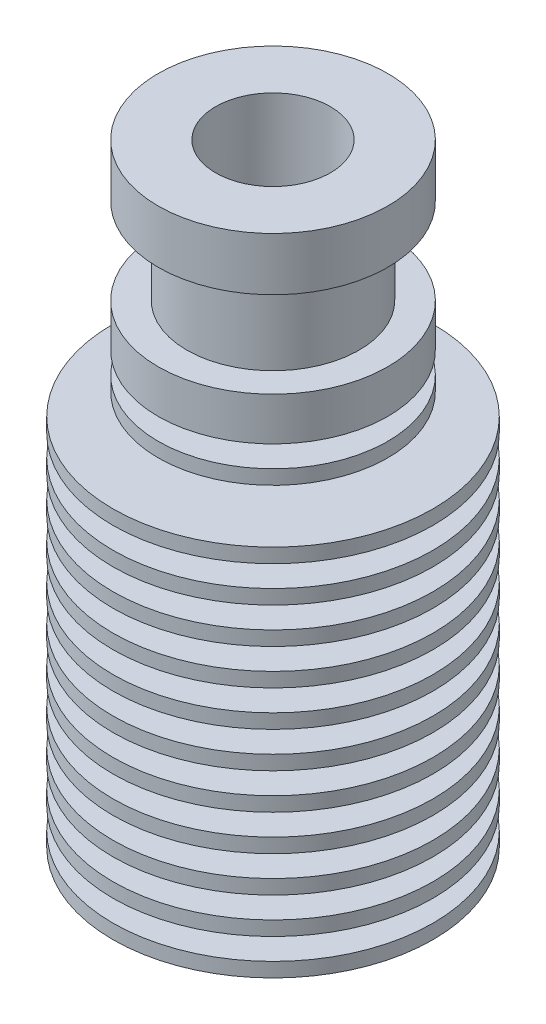
ISO-10303-21;
HEADER;
FILE_DESCRIPTION(('STEP AP214'),'2;1');
FILE_NAME('part.step','',(''),(''),'','','');
FILE_SCHEMA(('AUTOMOTIVE_DESIGN { 1 0 10303 214 1 1 1 1 }'));
ENDSEC;
DATA;
#1=APPLICATION_CONTEXT('core data for automotive mechanical design processes');
#2=APPLICATION_PROTOCOL_DEFINITION('international standard','automotive_design',2000,#1);
#3=PRODUCT_CONTEXT('',#1,'mechanical');
#4=PRODUCT('Part','Part','',(#3));
#5=PRODUCT_RELATED_PRODUCT_CATEGORY('part','',(#4));
#6=PRODUCT_DEFINITION_FORMATION('','',#4);
#7=PRODUCT_DEFINITION_CONTEXT('part definition',#1,'design');
#8=PRODUCT_DEFINITION('design','',#6,#7);
#9=PRODUCT_DEFINITION_SHAPE('','',#8);
#10=(LENGTH_UNIT() NAMED_UNIT(*) SI_UNIT(.MILLI.,.METRE.));
#11=(NAMED_UNIT(*) PLANE_ANGLE_UNIT() SI_UNIT($,.RADIAN.));
#12=(NAMED_UNIT(*) SI_UNIT($,.STERADIAN.) SOLID_ANGLE_UNIT());
#13=UNCERTAINTY_MEASURE_WITH_UNIT(LENGTH_MEASURE(1.E-05),#10,'distance_accuracy_value','');
#14=(GEOMETRIC_REPRESENTATION_CONTEXT(3) GLOBAL_UNCERTAINTY_ASSIGNED_CONTEXT((#13)) GLOBAL_UNIT_ASSIGNED_CONTEXT((#10,
#11,#12)) REPRESENTATION_CONTEXT('',''));
#15=CARTESIAN_POINT('',(0.,0.,0.));
#16=DIRECTION('',(0.,0.,1.));
#17=DIRECTION('',(1.,0.,0.));
#18=AXIS2_PLACEMENT_3D('',#15,#16,#17);
#19=CARTESIAN_POINT('',(-11.151,17.5,11.151));
#20=DIRECTION('',(0.,-1.,0.));
#21=DIRECTION('',(0.,0.,-1.));
#22=AXIS2_PLACEMENT_3D('',#19,#20,#21);
#23=PLANE('',#22);
#24=CARTESIAN_POINT('',(0.,17.5,0.));
#25=DIRECTION('',(0.,1.,0.));
#26=DIRECTION('',(0.,0.,1.));
#27=AXIS2_PLACEMENT_3D('',#24,#25,#26);
#28=CIRCLE('',#27,5.21388331075437);
#29=CARTESIAN_POINT('',(0.,17.5,5.21388331075437));
#30=VERTEX_POINT('',#29);
#31=EDGE_CURVE('E259',#30,#30,#28,.F.);
#32=ORIENTED_EDGE('',*,*,#31,.F.);
#33=EDGE_LOOP('',(#32));
#34=FACE_BOUND('',#33,.T.);
#35=CARTESIAN_POINT('',(0.,17.5,0.));
#36=DIRECTION('',(0.,1.,0.));
#37=DIRECTION('',(0.,0.,1.));
#38=AXIS2_PLACEMENT_3D('',#35,#36,#37);
#39=CIRCLE('',#38,11.15);
#40=CARTESIAN_POINT('',(0.,17.5,11.15));
#41=VERTEX_POINT('',#40);
#42=EDGE_CURVE('E18',#41,#41,#39,.T.);
#43=ORIENTED_EDGE('',*,*,#42,.F.);
#44=EDGE_LOOP('',(#43));
#45=FACE_BOUND('',#44,.T.);
#46=ADVANCED_FACE('F14',(#34,#45),#23,.T.);
#47=CARTESIAN_POINT('',(0.,17.5,0.));
#48=DIRECTION('',(0.,1.,0.));
#49=DIRECTION('',(0.,0.,1.));
#50=AXIS2_PLACEMENT_3D('',#47,#48,#49);
#51=CYLINDRICAL_SURFACE('',#50,11.15);
#52=CARTESIAN_POINT('',(0.,18.5,0.));
#53=DIRECTION('',(0.,1.,0.));
#54=DIRECTION('',(0.,0.,1.));
#55=AXIS2_PLACEMENT_3D('',#52,#53,#54);
#56=CIRCLE('',#55,11.15);
#57=CARTESIAN_POINT('',(0.,18.5,11.15));
#58=VERTEX_POINT('',#57);
#59=EDGE_CURVE('E256',#58,#58,#56,.T.);
#60=ORIENTED_EDGE('',*,*,#59,.F.);
#61=EDGE_LOOP('',(#60));
#62=FACE_BOUND('',#61,.T.);
#63=ORIENTED_EDGE('',*,*,#42,.T.);
#64=EDGE_LOOP('',(#63));
#65=FACE_BOUND('',#64,.T.);
#66=ADVANCED_FACE('F268',(#62,#65),#51,.T.);
#67=CARTESIAN_POINT('',(0.,16.,0.));
#68=DIRECTION('',(0.,1.,0.));
#69=DIRECTION('',(0.,0.,1.));
#70=AXIS2_PLACEMENT_3D('',#67,#68,#69);
#71=CYLINDRICAL_SURFACE('',#70,5.21388331075437);
#72=ORIENTED_EDGE('',*,*,#31,.T.);
#73=EDGE_LOOP('',(#72));
#74=FACE_BOUND('',#73,.T.);
#75=CARTESIAN_POINT('',(0.,16.,0.));
#76=DIRECTION('',(0.,1.,0.));
#77=DIRECTION('',(0.,0.,1.));
#78=AXIS2_PLACEMENT_3D('',#75,#76,#77);
#79=CIRCLE('',#78,5.21388331075437);
#80=CARTESIAN_POINT('',(0.,16.,5.21388331075437));
#81=VERTEX_POINT('',#80);
#82=EDGE_CURVE('E252',#81,#81,#79,.F.);
#83=ORIENTED_EDGE('',*,*,#82,.F.);
#84=EDGE_LOOP('',(#83));
#85=FACE_BOUND('',#84,.T.);
#86=ADVANCED_FACE('F278',(#74,#85),#71,.T.);
#87=CARTESIAN_POINT('',(-11.151,18.5,-11.151));
#88=DIRECTION('',(0.,1.,0.));
#89=DIRECTION('',(0.,0.,1.));
#90=AXIS2_PLACEMENT_3D('',#87,#88,#89);
#91=PLANE('',#90);
#92=CARTESIAN_POINT('',(0.,18.5,0.));
#93=DIRECTION('',(0.,1.,0.));
#94=DIRECTION('',(0.,0.,1.));
#95=AXIS2_PLACEMENT_3D('',#92,#93,#94);
#96=CIRCLE('',#95,5.08286386254677);
#97=CARTESIAN_POINT('',(0.,18.5,5.08286386254677));
#98=VERTEX_POINT('',#97);
#99=EDGE_CURVE('E248',#98,#98,#96,.T.);
#100=ORIENTED_EDGE('',*,*,#99,.F.);
#101=EDGE_LOOP('',(#100));
#102=FACE_BOUND('',#101,.T.);
#103=ORIENTED_EDGE('',*,*,#59,.T.);
#104=EDGE_LOOP('',(#103));
#105=FACE_BOUND('',#104,.T.);
#106=ADVANCED_FACE('F505',(#102,#105),#91,.T.);
#107=CARTESIAN_POINT('',(-11.151,16.,-11.151));
#108=DIRECTION('',(0.,1.,0.));
#109=DIRECTION('',(0.,0.,1.));
#110=AXIS2_PLACEMENT_3D('',#107,#108,#109);
#111=PLANE('',#110);
#112=ORIENTED_EDGE('',*,*,#82,.T.);
#113=EDGE_LOOP('',(#112));
#114=FACE_BOUND('',#113,.T.);
#115=CARTESIAN_POINT('',(0.,16.,0.));
#116=DIRECTION('',(0.,1.,0.));
#117=DIRECTION('',(0.,0.,1.));
#118=AXIS2_PLACEMENT_3D('',#115,#116,#117);
#119=CIRCLE('',#118,11.15);
#120=CARTESIAN_POINT('',(0.,16.,11.15));
#121=VERTEX_POINT('',#120);
#122=EDGE_CURVE('E244',#121,#121,#119,.F.);
#123=ORIENTED_EDGE('',*,*,#122,.F.);
#124=EDGE_LOOP('',(#123));
#125=FACE_BOUND('',#124,.T.);
#126=ADVANCED_FACE('F502',(#114,#125),#111,.T.);
#127=CARTESIAN_POINT('',(0.,18.5,0.));
#128=DIRECTION('',(0.,1.,0.));
#129=DIRECTION('',(0.,0.,1.));
#130=AXIS2_PLACEMENT_3D('',#127,#128,#129);
#131=CYLINDRICAL_SURFACE('',#130,5.08286386254677);
#132=CARTESIAN_POINT('',(0.,20.,0.));
#133=DIRECTION('',(0.,1.,0.));
#134=DIRECTION('',(0.,0.,1.));
#135=AXIS2_PLACEMENT_3D('',#132,#133,#134);
#136=CIRCLE('',#135,5.08286386254677);
#137=CARTESIAN_POINT('',(0.,20.,5.08286386254677));
#138=VERTEX_POINT('',#137);
#139=EDGE_CURVE('E240',#138,#138,#136,.T.);
#140=ORIENTED_EDGE('',*,*,#139,.F.);
#141=EDGE_LOOP('',(#140));
#142=FACE_BOUND('',#141,.T.);
#143=ORIENTED_EDGE('',*,*,#99,.T.);
#144=EDGE_LOOP('',(#143));
#145=FACE_BOUND('',#144,.T.);
#146=ADVANCED_FACE('F498',(#142,#145),#131,.T.);
#147=CARTESIAN_POINT('',(0.,15.,0.));
#148=DIRECTION('',(0.,1.,0.));
#149=DIRECTION('',(0.,0.,1.));
#150=AXIS2_PLACEMENT_3D('',#147,#148,#149);
#151=CYLINDRICAL_SURFACE('',#150,11.15);
#152=ORIENTED_EDGE('',*,*,#122,.T.);
#153=EDGE_LOOP('',(#152));
#154=FACE_BOUND('',#153,.T.);
#155=CARTESIAN_POINT('',(0.,15.,0.));
#156=DIRECTION('',(0.,1.,0.));
#157=DIRECTION('',(0.,0.,1.));
#158=AXIS2_PLACEMENT_3D('',#155,#156,#157);
#159=CIRCLE('',#158,11.15);
#160=CARTESIAN_POINT('',(0.,15.,11.15));
#161=VERTEX_POINT('',#160);
#162=EDGE_CURVE('E236',#161,#161,#159,.F.);
#163=ORIENTED_EDGE('',*,*,#162,.F.);
#164=EDGE_LOOP('',(#163));
#165=FACE_BOUND('',#164,.T.);
#166=ADVANCED_FACE('F494',(#154,#165),#151,.T.);
#167=CARTESIAN_POINT('',(-11.151,20.,11.151));
#168=DIRECTION('',(0.,-1.,0.));
#169=DIRECTION('',(0.,0.,-1.));
#170=AXIS2_PLACEMENT_3D('',#167,#168,#169);
#171=PLANE('',#170);
#172=ORIENTED_EDGE('',*,*,#139,.T.);
#173=EDGE_LOOP('',(#172));
#174=FACE_BOUND('',#173,.T.);
#175=CARTESIAN_POINT('',(0.,20.,0.));
#176=DIRECTION('',(0.,1.,0.));
#177=DIRECTION('',(0.,0.,1.));
#178=AXIS2_PLACEMENT_3D('',#175,#176,#177);
#179=CIRCLE('',#178,11.15);
#180=CARTESIAN_POINT('',(0.,20.,11.15));
#181=VERTEX_POINT('',#180);
#182=EDGE_CURVE('E232',#181,#181,#179,.T.);
#183=ORIENTED_EDGE('',*,*,#182,.F.);
#184=EDGE_LOOP('',(#183));
#185=FACE_BOUND('',#184,.T.);
#186=ADVANCED_FACE('F490',(#174,#185),#171,.T.);
#187=CARTESIAN_POINT('',(-11.151,15.,11.151));
#188=DIRECTION('',(0.,-1.,0.));
#189=DIRECTION('',(0.,0.,-1.));
#190=AXIS2_PLACEMENT_3D('',#187,#188,#189);
#191=PLANE('',#190);
#192=CARTESIAN_POINT('',(0.,15.,0.));
#193=DIRECTION('',(0.,1.,0.));
#194=DIRECTION('',(0.,0.,1.));
#195=AXIS2_PLACEMENT_3D('',#192,#193,#194);
#196=CIRCLE('',#195,5.34490275896198);
#197=CARTESIAN_POINT('',(0.,15.,5.34490275896198));
#198=VERTEX_POINT('',#197);
#199=EDGE_CURVE('E229',#198,#198,#196,.F.);
#200=ORIENTED_EDGE('',*,*,#199,.F.);
#201=EDGE_LOOP('',(#200));
#202=FACE_BOUND('',#201,.T.);
#203=ORIENTED_EDGE('',*,*,#162,.T.);
#204=EDGE_LOOP('',(#203));
#205=FACE_BOUND('',#204,.T.);
#206=ADVANCED_FACE('F486',(#202,#205),#191,.T.);
#207=CARTESIAN_POINT('',(0.,20.,0.));
#208=DIRECTION('',(0.,1.,0.));
#209=DIRECTION('',(0.,0.,1.));
#210=AXIS2_PLACEMENT_3D('',#207,#208,#209);
#211=CYLINDRICAL_SURFACE('',#210,11.15);
#212=CARTESIAN_POINT('',(0.,21.,0.));
#213=DIRECTION('',(0.,1.,0.));
#214=DIRECTION('',(0.,0.,1.));
#215=AXIS2_PLACEMENT_3D('',#212,#213,#214);
#216=CIRCLE('',#215,11.15);
#217=CARTESIAN_POINT('',(0.,21.,11.15));
#218=VERTEX_POINT('',#217);
#219=EDGE_CURVE('E225',#218,#218,#216,.T.);
#220=ORIENTED_EDGE('',*,*,#219,.F.);
#221=EDGE_LOOP('',(#220));
#222=FACE_BOUND('',#221,.T.);
#223=ORIENTED_EDGE('',*,*,#182,.T.);
#224=EDGE_LOOP('',(#223));
#225=FACE_BOUND('',#224,.T.);
#226=ADVANCED_FACE('F482',(#222,#225),#211,.T.);
#227=CARTESIAN_POINT('',(0.,13.5,0.));
#228=DIRECTION('',(0.,1.,0.));
#229=DIRECTION('',(0.,0.,1.));
#230=AXIS2_PLACEMENT_3D('',#227,#228,#229);
#231=CYLINDRICAL_SURFACE('',#230,5.34490275896198);
#232=ORIENTED_EDGE('',*,*,#199,.T.);
#233=EDGE_LOOP('',(#232));
#234=FACE_BOUND('',#233,.T.);
#235=CARTESIAN_POINT('',(0.,13.5,0.));
#236=DIRECTION('',(0.,1.,0.));
#237=DIRECTION('',(0.,0.,1.));
#238=AXIS2_PLACEMENT_3D('',#235,#236,#237);
#239=CIRCLE('',#238,5.34490275896198);
#240=CARTESIAN_POINT('',(0.,13.5,5.34490275896198));
#241=VERTEX_POINT('',#240);
#242=EDGE_CURVE('E222',#241,#241,#239,.F.);
#243=ORIENTED_EDGE('',*,*,#242,.F.);
#244=EDGE_LOOP('',(#243));
#245=FACE_BOUND('',#244,.T.);
#246=ADVANCED_FACE('F478',(#234,#245),#231,.T.);
#247=CARTESIAN_POINT('',(-11.151,21.,-11.151));
#248=DIRECTION('',(0.,1.,0.));
#249=DIRECTION('',(0.,0.,1.));
#250=AXIS2_PLACEMENT_3D('',#247,#248,#249);
#251=PLANE('',#250);
#252=CARTESIAN_POINT('',(0.,21.,0.));
#253=DIRECTION('',(0.,1.,0.));
#254=DIRECTION('',(0.,0.,1.));
#255=AXIS2_PLACEMENT_3D('',#252,#253,#254);
#256=CIRCLE('',#255,4.95184441433916);
#257=CARTESIAN_POINT('',(0.,21.,4.95184441433916));
#258=VERTEX_POINT('',#257);
#259=EDGE_CURVE('E218',#258,#258,#256,.T.);
#260=ORIENTED_EDGE('',*,*,#259,.F.);
#261=EDGE_LOOP('',(#260));
#262=FACE_BOUND('',#261,.T.);
#263=ORIENTED_EDGE('',*,*,#219,.T.);
#264=EDGE_LOOP('',(#263));
#265=FACE_BOUND('',#264,.T.);
#266=ADVANCED_FACE('F474',(#262,#265),#251,.T.);
#267=CARTESIAN_POINT('',(-11.151,13.5,-11.151));
#268=DIRECTION('',(0.,1.,0.));
#269=DIRECTION('',(0.,0.,1.));
#270=AXIS2_PLACEMENT_3D('',#267,#268,#269);
#271=PLANE('',#270);
#272=ORIENTED_EDGE('',*,*,#242,.T.);
#273=EDGE_LOOP('',(#272));
#274=FACE_BOUND('',#273,.T.);
#275=CARTESIAN_POINT('',(0.,13.5,0.));
#276=DIRECTION('',(0.,1.,0.));
#277=DIRECTION('',(0.,0.,1.));
#278=AXIS2_PLACEMENT_3D('',#275,#276,#277);
#279=CIRCLE('',#278,11.15);
#280=CARTESIAN_POINT('',(0.,13.5,11.15));
#281=VERTEX_POINT('',#280);
#282=EDGE_CURVE('E214',#281,#281,#279,.F.);
#283=ORIENTED_EDGE('',*,*,#282,.F.);
#284=EDGE_LOOP('',(#283));
#285=FACE_BOUND('',#284,.T.);
#286=ADVANCED_FACE('F470',(#274,#285),#271,.T.);
#287=CARTESIAN_POINT('',(0.,21.,0.));
#288=DIRECTION('',(0.,1.,0.));
#289=DIRECTION('',(0.,0.,1.));
#290=AXIS2_PLACEMENT_3D('',#287,#288,#289);
#291=CYLINDRICAL_SURFACE('',#290,4.95184441433916);
#292=CARTESIAN_POINT('',(0.,22.5,0.));
#293=DIRECTION('',(0.,1.,0.));
#294=DIRECTION('',(0.,0.,1.));
#295=AXIS2_PLACEMENT_3D('',#292,#293,#294);
#296=CIRCLE('',#295,4.95184441433916);
#297=CARTESIAN_POINT('',(0.,22.5,4.95184441433916));
#298=VERTEX_POINT('',#297);
#299=EDGE_CURVE('E210',#298,#298,#296,.T.);
#300=ORIENTED_EDGE('',*,*,#299,.F.);
#301=EDGE_LOOP('',(#300));
#302=FACE_BOUND('',#301,.T.);
#303=ORIENTED_EDGE('',*,*,#259,.T.);
#304=EDGE_LOOP('',(#303));
#305=FACE_BOUND('',#304,.T.);
#306=ADVANCED_FACE('F466',(#302,#305),#291,.T.);
#307=CARTESIAN_POINT('',(0.,12.5,0.));
#308=DIRECTION('',(0.,1.,0.));
#309=DIRECTION('',(0.,0.,1.));
#310=AXIS2_PLACEMENT_3D('',#307,#308,#309);
#311=CYLINDRICAL_SURFACE('',#310,11.15);
#312=ORIENTED_EDGE('',*,*,#282,.T.);
#313=EDGE_LOOP('',(#312));
#314=FACE_BOUND('',#313,.T.);
#315=CARTESIAN_POINT('',(0.,12.5,0.));
#316=DIRECTION('',(0.,1.,0.));
#317=DIRECTION('',(0.,0.,1.));
#318=AXIS2_PLACEMENT_3D('',#315,#316,#317);
#319=CIRCLE('',#318,11.15);
#320=CARTESIAN_POINT('',(0.,12.5,11.15));
#321=VERTEX_POINT('',#320);
#322=EDGE_CURVE('E206',#321,#321,#319,.F.);
#323=ORIENTED_EDGE('',*,*,#322,.F.);
#324=EDGE_LOOP('',(#323));
#325=FACE_BOUND('',#324,.T.);
#326=ADVANCED_FACE('F462',(#314,#325),#311,.T.);
#327=CARTESIAN_POINT('',(-11.151,22.5,11.151));
#328=DIRECTION('',(0.,-1.,0.));
#329=DIRECTION('',(0.,0.,-1.));
#330=AXIS2_PLACEMENT_3D('',#327,#328,#329);
#331=PLANE('',#330);
#332=ORIENTED_EDGE('',*,*,#299,.T.);
#333=EDGE_LOOP('',(#332));
#334=FACE_BOUND('',#333,.T.);
#335=CARTESIAN_POINT('',(0.,22.5,0.));
#336=DIRECTION('',(0.,1.,0.));
#337=DIRECTION('',(0.,0.,1.));
#338=AXIS2_PLACEMENT_3D('',#335,#336,#337);
#339=CIRCLE('',#338,11.15);
#340=CARTESIAN_POINT('',(0.,22.5,11.15));
#341=VERTEX_POINT('',#340);
#342=EDGE_CURVE('E202',#341,#341,#339,.T.);
#343=ORIENTED_EDGE('',*,*,#342,.F.);
#344=EDGE_LOOP('',(#343));
#345=FACE_BOUND('',#344,.T.);
#346=ADVANCED_FACE('F458',(#334,#345),#331,.T.);
#347=CARTESIAN_POINT('',(-11.151,12.5,11.151));
#348=DIRECTION('',(0.,-1.,0.));
#349=DIRECTION('',(0.,0.,-1.));
#350=AXIS2_PLACEMENT_3D('',#347,#348,#349);
#351=PLANE('',#350);
#352=CARTESIAN_POINT('',(0.,12.5,0.));
#353=DIRECTION('',(0.,1.,0.));
#354=DIRECTION('',(0.,0.,1.));
#355=AXIS2_PLACEMENT_3D('',#352,#353,#354);
#356=CIRCLE('',#355,5.47592220716958);
#357=CARTESIAN_POINT('',(0.,12.5,5.47592220716958));
#358=VERTEX_POINT('',#357);
#359=EDGE_CURVE('E198',#358,#358,#356,.F.);
#360=ORIENTED_EDGE('',*,*,#359,.F.);
#361=EDGE_LOOP('',(#360));
#362=FACE_BOUND('',#361,.T.);
#363=ORIENTED_EDGE('',*,*,#322,.T.);
#364=EDGE_LOOP('',(#363));
#365=FACE_BOUND('',#364,.T.);
#366=ADVANCED_FACE('F454',(#362,#365),#351,.T.);
#367=CARTESIAN_POINT('',(0.,22.5,0.));
#368=DIRECTION('',(0.,1.,0.));
#369=DIRECTION('',(0.,0.,1.));
#370=AXIS2_PLACEMENT_3D('',#367,#368,#369);
#371=CYLINDRICAL_SURFACE('',#370,11.15);
#372=CARTESIAN_POINT('',(0.,23.5,0.));
#373=DIRECTION('',(0.,1.,0.));
#374=DIRECTION('',(0.,0.,1.));
#375=AXIS2_PLACEMENT_3D('',#372,#373,#374);
#376=CIRCLE('',#375,11.15);
#377=CARTESIAN_POINT('',(0.,23.5,11.15));
#378=VERTEX_POINT('',#377);
#379=EDGE_CURVE('E194',#378,#378,#376,.T.);
#380=ORIENTED_EDGE('',*,*,#379,.F.);
#381=EDGE_LOOP('',(#380));
#382=FACE_BOUND('',#381,.T.);
#383=ORIENTED_EDGE('',*,*,#342,.T.);
#384=EDGE_LOOP('',(#383));
#385=FACE_BOUND('',#384,.T.);
#386=ADVANCED_FACE('F450',(#382,#385),#371,.T.);
#387=CARTESIAN_POINT('',(0.,11.,0.));
#388=DIRECTION('',(0.,1.,0.));
#389=DIRECTION('',(0.,0.,1.));
#390=AXIS2_PLACEMENT_3D('',#387,#388,#389);
#391=CYLINDRICAL_SURFACE('',#390,5.47592220716958);
#392=ORIENTED_EDGE('',*,*,#359,.T.);
#393=EDGE_LOOP('',(#392));
#394=FACE_BOUND('',#393,.T.);
#395=CARTESIAN_POINT('',(0.,11.,0.));
#396=DIRECTION('',(0.,1.,0.));
#397=DIRECTION('',(0.,0.,1.));
#398=AXIS2_PLACEMENT_3D('',#395,#396,#397);
#399=CIRCLE('',#398,5.47592220716958);
#400=CARTESIAN_POINT('',(0.,11.,5.47592220716958));
#401=VERTEX_POINT('',#400);
#402=EDGE_CURVE('E190',#401,#401,#399,.F.);
#403=ORIENTED_EDGE('',*,*,#402,.F.);
#404=EDGE_LOOP('',(#403));
#405=FACE_BOUND('',#404,.T.);
#406=ADVANCED_FACE('F446',(#394,#405),#391,.T.);
#407=CARTESIAN_POINT('',(-11.151,23.5,-11.151));
#408=DIRECTION('',(0.,1.,0.));
#409=DIRECTION('',(0.,0.,1.));
#410=AXIS2_PLACEMENT_3D('',#407,#408,#409);
#411=PLANE('',#410);
#412=CARTESIAN_POINT('',(0.,23.5,0.));
#413=DIRECTION('',(0.,1.,0.));
#414=DIRECTION('',(0.,0.,1.));
#415=AXIS2_PLACEMENT_3D('',#412,#413,#414);
#416=CIRCLE('',#415,4.82082496613156);
#417=CARTESIAN_POINT('',(0.,23.5,4.82082496613156));
#418=VERTEX_POINT('',#417);
#419=EDGE_CURVE('E186',#418,#418,#416,.T.);
#420=ORIENTED_EDGE('',*,*,#419,.F.);
#421=EDGE_LOOP('',(#420));
#422=FACE_BOUND('',#421,.T.);
#423=ORIENTED_EDGE('',*,*,#379,.T.);
#424=EDGE_LOOP('',(#423));
#425=FACE_BOUND('',#424,.T.);
#426=ADVANCED_FACE('F442',(#422,#425),#411,.T.);
#427=CARTESIAN_POINT('',(-11.151,11.,-11.151));
#428=DIRECTION('',(0.,1.,0.));
#429=DIRECTION('',(0.,0.,1.));
#430=AXIS2_PLACEMENT_3D('',#427,#428,#429);
#431=PLANE('',#430);
#432=ORIENTED_EDGE('',*,*,#402,.T.);
#433=EDGE_LOOP('',(#432));
#434=FACE_BOUND('',#433,.T.);
#435=CARTESIAN_POINT('',(0.,11.,0.));
#436=DIRECTION('',(0.,1.,0.));
#437=DIRECTION('',(0.,0.,1.));
#438=AXIS2_PLACEMENT_3D('',#435,#436,#437);
#439=CIRCLE('',#438,11.15);
#440=CARTESIAN_POINT('',(0.,11.,11.15));
#441=VERTEX_POINT('',#440);
#442=EDGE_CURVE('E182',#441,#441,#439,.F.);
#443=ORIENTED_EDGE('',*,*,#442,.F.);
#444=EDGE_LOOP('',(#443));
#445=FACE_BOUND('',#444,.T.);
#446=ADVANCED_FACE('F438',(#434,#445),#431,.T.);
#447=CARTESIAN_POINT('',(0.,23.5,0.));
#448=DIRECTION('',(0.,1.,0.));
#449=DIRECTION('',(0.,0.,1.));
#450=AXIS2_PLACEMENT_3D('',#447,#448,#449);
#451=CYLINDRICAL_SURFACE('',#450,4.82082496613156);
#452=CARTESIAN_POINT('',(0.,25.,0.));
#453=DIRECTION('',(0.,1.,0.));
#454=DIRECTION('',(0.,0.,1.));
#455=AXIS2_PLACEMENT_3D('',#452,#453,#454);
#456=CIRCLE('',#455,4.82082496613156);
#457=CARTESIAN_POINT('',(0.,25.,4.82082496613156));
#458=VERTEX_POINT('',#457);
#459=EDGE_CURVE('E178',#458,#458,#456,.T.);
#460=ORIENTED_EDGE('',*,*,#459,.F.);
#461=EDGE_LOOP('',(#460));
#462=FACE_BOUND('',#461,.T.);
#463=ORIENTED_EDGE('',*,*,#419,.T.);
#464=EDGE_LOOP('',(#463));
#465=FACE_BOUND('',#464,.T.);
#466=ADVANCED_FACE('F434',(#462,#465),#451,.T.);
#467=CARTESIAN_POINT('',(0.,9.99999999999999,0.));
#468=DIRECTION('',(0.,1.,0.));
#469=DIRECTION('',(0.,0.,1.));
#470=AXIS2_PLACEMENT_3D('',#467,#468,#469);
#471=CYLINDRICAL_SURFACE('',#470,11.15);
#472=ORIENTED_EDGE('',*,*,#442,.T.);
#473=EDGE_LOOP('',(#472));
#474=FACE_BOUND('',#473,.T.);
#475=CARTESIAN_POINT('',(0.,10.,0.));
#476=DIRECTION('',(0.,1.,0.));
#477=DIRECTION('',(0.,0.,1.));
#478=AXIS2_PLACEMENT_3D('',#475,#476,#477);
#479=CIRCLE('',#478,11.15);
#480=CARTESIAN_POINT('',(0.,10.,11.15));
#481=VERTEX_POINT('',#480);
#482=EDGE_CURVE('E174',#481,#481,#479,.F.);
#483=ORIENTED_EDGE('',*,*,#482,.F.);
#484=EDGE_LOOP('',(#483));
#485=FACE_BOUND('',#484,.T.);
#486=ADVANCED_FACE('F430',(#474,#485),#471,.T.);
#487=CARTESIAN_POINT('',(-11.151,25.,11.151));
#488=DIRECTION('',(0.,-1.,0.));
#489=DIRECTION('',(0.,0.,-1.));
#490=AXIS2_PLACEMENT_3D('',#487,#488,#489);
#491=PLANE('',#490);
#492=ORIENTED_EDGE('',*,*,#459,.T.);
#493=EDGE_LOOP('',(#492));
#494=FACE_BOUND('',#493,.T.);
#495=CARTESIAN_POINT('',(0.,25.,0.));
#496=DIRECTION('',(0.,1.,0.));
#497=DIRECTION('',(0.,0.,1.));
#498=AXIS2_PLACEMENT_3D('',#495,#496,#497);
#499=CIRCLE('',#498,11.15);
#500=CARTESIAN_POINT('',(0.,25.,11.15));
#501=VERTEX_POINT('',#500);
#502=EDGE_CURVE('E170',#501,#501,#499,.T.);
#503=ORIENTED_EDGE('',*,*,#502,.F.);
#504=EDGE_LOOP('',(#503));
#505=FACE_BOUND('',#504,.T.);
#506=ADVANCED_FACE('F426',(#494,#505),#491,.T.);
#507=CARTESIAN_POINT('',(-11.151,10.,11.151));
#508=DIRECTION('',(0.,-1.,0.));
#509=DIRECTION('',(0.,0.,-1.));
#510=AXIS2_PLACEMENT_3D('',#507,#508,#509);
#511=PLANE('',#510);
#512=CARTESIAN_POINT('',(0.,10.,0.));
#513=DIRECTION('',(0.,1.,0.));
#514=DIRECTION('',(0.,0.,1.));
#515=AXIS2_PLACEMENT_3D('',#512,#513,#514);
#516=CIRCLE('',#515,5.60694165537719);
#517=CARTESIAN_POINT('',(0.,10.,5.60694165537719));
#518=VERTEX_POINT('',#517);
#519=EDGE_CURVE('E166',#518,#518,#516,.F.);
#520=ORIENTED_EDGE('',*,*,#519,.F.);
#521=EDGE_LOOP('',(#520));
#522=FACE_BOUND('',#521,.T.);
#523=ORIENTED_EDGE('',*,*,#482,.T.);
#524=EDGE_LOOP('',(#523));
#525=FACE_BOUND('',#524,.T.);
#526=ADVANCED_FACE('F422',(#522,#525),#511,.T.);
#527=CARTESIAN_POINT('',(0.,25.,0.));
#528=DIRECTION('',(0.,1.,0.));
#529=DIRECTION('',(0.,0.,1.));
#530=AXIS2_PLACEMENT_3D('',#527,#528,#529);
#531=CYLINDRICAL_SURFACE('',#530,11.15);
#532=CARTESIAN_POINT('',(0.,26.,0.));
#533=DIRECTION('',(0.,1.,0.));
#534=DIRECTION('',(0.,0.,1.));
#535=AXIS2_PLACEMENT_3D('',#532,#533,#534);
#536=CIRCLE('',#535,11.15);
#537=CARTESIAN_POINT('',(0.,26.,11.15));
#538=VERTEX_POINT('',#537);
#539=EDGE_CURVE('E162',#538,#538,#536,.T.);
#540=ORIENTED_EDGE('',*,*,#539,.F.);
#541=EDGE_LOOP('',(#540));
#542=FACE_BOUND('',#541,.T.);
#543=ORIENTED_EDGE('',*,*,#502,.T.);
#544=EDGE_LOOP('',(#543));
#545=FACE_BOUND('',#544,.T.);
#546=ADVANCED_FACE('F418',(#542,#545),#531,.T.);
#547=CARTESIAN_POINT('',(0.,8.5,0.));
#548=DIRECTION('',(0.,1.,0.));
#549=DIRECTION('',(0.,0.,1.));
#550=AXIS2_PLACEMENT_3D('',#547,#548,#549);
#551=CYLINDRICAL_SURFACE('',#550,5.60694165537719);
#552=ORIENTED_EDGE('',*,*,#519,.T.);
#553=EDGE_LOOP('',(#552));
#554=FACE_BOUND('',#553,.T.);
#555=CARTESIAN_POINT('',(0.,8.5,0.));
#556=DIRECTION('',(0.,1.,0.));
#557=DIRECTION('',(0.,0.,1.));
#558=AXIS2_PLACEMENT_3D('',#555,#556,#557);
#559=CIRCLE('',#558,5.60694165537719);
#560=CARTESIAN_POINT('',(0.,8.5,5.60694165537719));
#561=VERTEX_POINT('',#560);
#562=EDGE_CURVE('E158',#561,#561,#559,.F.);
#563=ORIENTED_EDGE('',*,*,#562,.F.);
#564=EDGE_LOOP('',(#563));
#565=FACE_BOUND('',#564,.T.);
#566=ADVANCED_FACE('F415',(#554,#565),#551,.T.);
#567=CARTESIAN_POINT('',(-11.151,26.,-11.151));
#568=DIRECTION('',(0.,1.,0.));
#569=DIRECTION('',(0.,0.,1.));
#570=AXIS2_PLACEMENT_3D('',#567,#568,#569);
#571=PLANE('',#570);
#572=CARTESIAN_POINT('',(0.,26.,0.));
#573=DIRECTION('',(0.,1.,0.));
#574=DIRECTION('',(0.,0.,1.));
#575=AXIS2_PLACEMENT_3D('',#572,#573,#574);
#576=CIRCLE('',#575,4.68980551792396);
#577=CARTESIAN_POINT('',(0.,26.,4.68980551792396));
#578=VERTEX_POINT('',#577);
#579=EDGE_CURVE('E154',#578,#578,#576,.T.);
#580=ORIENTED_EDGE('',*,*,#579,.F.);
#581=EDGE_LOOP('',(#580));
#582=FACE_BOUND('',#581,.T.);
#583=ORIENTED_EDGE('',*,*,#539,.T.);
#584=EDGE_LOOP('',(#583));
#585=FACE_BOUND('',#584,.T.);
#586=ADVANCED_FACE('F411',(#582,#585),#571,.T.);
#587=CARTESIAN_POINT('',(-11.151,8.5,-11.151));
#588=DIRECTION('',(0.,1.,0.));
#589=DIRECTION('',(0.,0.,1.));
#590=AXIS2_PLACEMENT_3D('',#587,#588,#589);
#591=PLANE('',#590);
#592=ORIENTED_EDGE('',*,*,#562,.T.);
#593=EDGE_LOOP('',(#592));
#594=FACE_BOUND('',#593,.T.);
#595=CARTESIAN_POINT('',(0.,8.5,0.));
#596=DIRECTION('',(0.,1.,0.));
#597=DIRECTION('',(0.,0.,1.));
#598=AXIS2_PLACEMENT_3D('',#595,#596,#597);
#599=CIRCLE('',#598,11.15);
#600=CARTESIAN_POINT('',(0.,8.5,11.15));
#601=VERTEX_POINT('',#600);
#602=EDGE_CURVE('E150',#601,#601,#599,.F.);
#603=ORIENTED_EDGE('',*,*,#602,.F.);
#604=EDGE_LOOP('',(#603));
#605=FACE_BOUND('',#604,.T.);
#606=ADVANCED_FACE('F407',(#594,#605),#591,.T.);
#607=CARTESIAN_POINT('',(0.,26.,0.));
#608=DIRECTION('',(0.,1.,0.));
#609=DIRECTION('',(0.,0.,1.));
#610=AXIS2_PLACEMENT_3D('',#607,#608,#609);
#611=CYLINDRICAL_SURFACE('',#610,4.68980551792396);
#612=CARTESIAN_POINT('',(0.,27.5,0.));
#613=DIRECTION('',(0.,1.,0.));
#614=DIRECTION('',(0.,0.,1.));
#615=AXIS2_PLACEMENT_3D('',#612,#613,#614);
#616=CIRCLE('',#615,4.68980551792396);
#617=CARTESIAN_POINT('',(0.,27.5,4.68980551792396));
#618=VERTEX_POINT('',#617);
#619=EDGE_CURVE('E146',#618,#618,#616,.T.);
#620=ORIENTED_EDGE('',*,*,#619,.F.);
#621=EDGE_LOOP('',(#620));
#622=FACE_BOUND('',#621,.T.);
#623=ORIENTED_EDGE('',*,*,#579,.T.);
#624=EDGE_LOOP('',(#623));
#625=FACE_BOUND('',#624,.T.);
#626=ADVANCED_FACE('F404',(#622,#625),#611,.T.);
#627=CARTESIAN_POINT('',(0.,7.5,0.));
#628=DIRECTION('',(0.,1.,0.));
#629=DIRECTION('',(0.,0.,1.));
#630=AXIS2_PLACEMENT_3D('',#627,#628,#629);
#631=CYLINDRICAL_SURFACE('',#630,11.15);
#632=ORIENTED_EDGE('',*,*,#602,.T.);
#633=EDGE_LOOP('',(#632));
#634=FACE_BOUND('',#633,.T.);
#635=CARTESIAN_POINT('',(0.,7.5,0.));
#636=DIRECTION('',(0.,1.,0.));
#637=DIRECTION('',(0.,0.,1.));
#638=AXIS2_PLACEMENT_3D('',#635,#636,#637);
#639=CIRCLE('',#638,11.15);
#640=CARTESIAN_POINT('',(0.,7.5,11.15));
#641=VERTEX_POINT('',#640);
#642=EDGE_CURVE('E142',#641,#641,#639,.F.);
#643=ORIENTED_EDGE('',*,*,#642,.F.);
#644=EDGE_LOOP('',(#643));
#645=FACE_BOUND('',#644,.T.);
#646=ADVANCED_FACE('F400',(#634,#645),#631,.T.);
#647=CARTESIAN_POINT('',(-8.001,27.5,8.001));
#648=DIRECTION('',(0.,-1.,0.));
#649=DIRECTION('',(0.,0.,-1.));
#650=AXIS2_PLACEMENT_3D('',#647,#648,#649);
#651=PLANE('',#650);
#652=ORIENTED_EDGE('',*,*,#619,.T.);
#653=EDGE_LOOP('',(#652));
#654=FACE_BOUND('',#653,.T.);
#655=CARTESIAN_POINT('',(0.,27.5,0.));
#656=DIRECTION('',(0.,1.,0.));
#657=DIRECTION('',(0.,0.,1.));
#658=AXIS2_PLACEMENT_3D('',#655,#656,#657);
#659=CIRCLE('',#658,8.);
#660=CARTESIAN_POINT('',(0.,27.5,8.));
#661=VERTEX_POINT('',#660);
#662=EDGE_CURVE('E138',#661,#661,#659,.T.);
#663=ORIENTED_EDGE('',*,*,#662,.F.);
#664=EDGE_LOOP('',(#663));
#665=FACE_BOUND('',#664,.T.);
#666=ADVANCED_FACE('F396',(#654,#665),#651,.T.);
#667=CARTESIAN_POINT('',(-11.151,7.5,11.151));
#668=DIRECTION('',(0.,-1.,0.));
#669=DIRECTION('',(0.,0.,-1.));
#670=AXIS2_PLACEMENT_3D('',#667,#668,#669);
#671=PLANE('',#670);
#672=CARTESIAN_POINT('',(0.,7.5,0.));
#673=DIRECTION('',(0.,1.,0.));
#674=DIRECTION('',(0.,0.,1.));
#675=AXIS2_PLACEMENT_3D('',#672,#673,#674);
#676=CIRCLE('',#675,5.73796110358479);
#677=CARTESIAN_POINT('',(0.,7.5,5.73796110358479));
#678=VERTEX_POINT('',#677);
#679=EDGE_CURVE('E134',#678,#678,#676,.F.);
#680=ORIENTED_EDGE('',*,*,#679,.F.);
#681=EDGE_LOOP('',(#680));
#682=FACE_BOUND('',#681,.T.);
#683=ORIENTED_EDGE('',*,*,#642,.T.);
#684=EDGE_LOOP('',(#683));
#685=FACE_BOUND('',#684,.T.);
#686=ADVANCED_FACE('F392',(#682,#685),#671,.T.);
#687=CARTESIAN_POINT('',(0.,27.5,0.));
#688=DIRECTION('',(0.,1.,0.));
#689=DIRECTION('',(0.,0.,1.));
#690=AXIS2_PLACEMENT_3D('',#687,#688,#689);
#691=CYLINDRICAL_SURFACE('',#690,8.);
#692=CARTESIAN_POINT('',(0.,28.5,0.));
#693=DIRECTION('',(0.,1.,0.));
#694=DIRECTION('',(0.,0.,1.));
#695=AXIS2_PLACEMENT_3D('',#692,#693,#694);
#696=CIRCLE('',#695,8.);
#697=CARTESIAN_POINT('',(0.,28.5,8.));
#698=VERTEX_POINT('',#697);
#699=EDGE_CURVE('E130',#698,#698,#696,.T.);
#700=ORIENTED_EDGE('',*,*,#699,.F.);
#701=EDGE_LOOP('',(#700));
#702=FACE_BOUND('',#701,.T.);
#703=ORIENTED_EDGE('',*,*,#662,.T.);
#704=EDGE_LOOP('',(#703));
#705=FACE_BOUND('',#704,.T.);
#706=ADVANCED_FACE('F388',(#702,#705),#691,.T.);
#707=CARTESIAN_POINT('',(0.,6.,0.));
#708=DIRECTION('',(0.,1.,0.));
#709=DIRECTION('',(0.,0.,1.));
#710=AXIS2_PLACEMENT_3D('',#707,#708,#709);
#711=CYLINDRICAL_SURFACE('',#710,5.73796110358479);
#712=ORIENTED_EDGE('',*,*,#679,.T.);
#713=EDGE_LOOP('',(#712));
#714=FACE_BOUND('',#713,.T.);
#715=CARTESIAN_POINT('',(0.,6.,0.));
#716=DIRECTION('',(0.,1.,0.));
#717=DIRECTION('',(0.,0.,1.));
#718=AXIS2_PLACEMENT_3D('',#715,#716,#717);
#719=CIRCLE('',#718,5.73796110358479);
#720=CARTESIAN_POINT('',(0.,6.,5.73796110358479));
#721=VERTEX_POINT('',#720);
#722=EDGE_CURVE('E126',#721,#721,#719,.F.);
#723=ORIENTED_EDGE('',*,*,#722,.F.);
#724=EDGE_LOOP('',(#723));
#725=FACE_BOUND('',#724,.T.);
#726=ADVANCED_FACE('F384',(#714,#725),#711,.T.);
#727=CARTESIAN_POINT('',(-8.001,28.5,-8.001));
#728=DIRECTION('',(0.,1.,0.));
#729=DIRECTION('',(0.,0.,1.));
#730=AXIS2_PLACEMENT_3D('',#727,#728,#729);
#731=PLANE('',#730);
#732=CARTESIAN_POINT('',(0.,28.5,0.));
#733=DIRECTION('',(0.,1.,0.));
#734=DIRECTION('',(0.,0.,1.));
#735=AXIS2_PLACEMENT_3D('',#732,#733,#734);
#736=CIRCLE('',#735,4.68980551792396);
#737=CARTESIAN_POINT('',(0.,28.5,4.68980551792396));
#738=VERTEX_POINT('',#737);
#739=EDGE_CURVE('E122',#738,#738,#736,.T.);
#740=ORIENTED_EDGE('',*,*,#739,.F.);
#741=EDGE_LOOP('',(#740));
#742=FACE_BOUND('',#741,.T.);
#743=ORIENTED_EDGE('',*,*,#699,.T.);
#744=EDGE_LOOP('',(#743));
#745=FACE_BOUND('',#744,.T.);
#746=ADVANCED_FACE('F380',(#742,#745),#731,.T.);
#747=CARTESIAN_POINT('',(-11.151,6.,-11.151));
#748=DIRECTION('',(0.,1.,0.));
#749=DIRECTION('',(0.,0.,1.));
#750=AXIS2_PLACEMENT_3D('',#747,#748,#749);
#751=PLANE('',#750);
#752=ORIENTED_EDGE('',*,*,#722,.T.);
#753=EDGE_LOOP('',(#752));
#754=FACE_BOUND('',#753,.T.);
#755=CARTESIAN_POINT('',(0.,6.,0.));
#756=DIRECTION('',(0.,1.,0.));
#757=DIRECTION('',(0.,0.,1.));
#758=AXIS2_PLACEMENT_3D('',#755,#756,#757);
#759=CIRCLE('',#758,11.15);
#760=CARTESIAN_POINT('',(0.,6.,11.15));
#761=VERTEX_POINT('',#760);
#762=EDGE_CURVE('E118',#761,#761,#759,.F.);
#763=ORIENTED_EDGE('',*,*,#762,.F.);
#764=EDGE_LOOP('',(#763));
#765=FACE_BOUND('',#764,.T.);
#766=ADVANCED_FACE('F376',(#754,#765),#751,.T.);
#767=CARTESIAN_POINT('',(0.,28.5,0.));
#768=DIRECTION('',(0.,1.,0.));
#769=DIRECTION('',(0.,0.,1.));
#770=AXIS2_PLACEMENT_3D('',#767,#768,#769);
#771=CYLINDRICAL_SURFACE('',#770,4.68980551792396);
#772=CARTESIAN_POINT('',(0.,30.,0.));
#773=DIRECTION('',(0.,1.,0.));
#774=DIRECTION('',(0.,0.,1.));
#775=AXIS2_PLACEMENT_3D('',#772,#773,#774);
#776=CIRCLE('',#775,4.68980551792396);
#777=CARTESIAN_POINT('',(0.,30.,4.68980551792396));
#778=VERTEX_POINT('',#777);
#779=EDGE_CURVE('E114',#778,#778,#776,.T.);
#780=ORIENTED_EDGE('',*,*,#779,.F.);
#781=EDGE_LOOP('',(#780));
#782=FACE_BOUND('',#781,.T.);
#783=ORIENTED_EDGE('',*,*,#739,.T.);
#784=EDGE_LOOP('',(#783));
#785=FACE_BOUND('',#784,.T.);
#786=ADVANCED_FACE('F372',(#782,#785),#771,.T.);
#787=CARTESIAN_POINT('',(0.,5.,0.));
#788=DIRECTION('',(0.,1.,0.));
#789=DIRECTION('',(0.,0.,1.));
#790=AXIS2_PLACEMENT_3D('',#787,#788,#789);
#791=CYLINDRICAL_SURFACE('',#790,11.15);
#792=ORIENTED_EDGE('',*,*,#762,.T.);
#793=EDGE_LOOP('',(#792));
#794=FACE_BOUND('',#793,.T.);
#795=CARTESIAN_POINT('',(0.,5.,0.));
#796=DIRECTION('',(0.,1.,0.));
#797=DIRECTION('',(0.,0.,1.));
#798=AXIS2_PLACEMENT_3D('',#795,#796,#797);
#799=CIRCLE('',#798,11.15);
#800=CARTESIAN_POINT('',(0.,5.,11.15));
#801=VERTEX_POINT('',#800);
#802=EDGE_CURVE('E110',#801,#801,#799,.F.);
#803=ORIENTED_EDGE('',*,*,#802,.F.);
#804=EDGE_LOOP('',(#803));
#805=FACE_BOUND('',#804,.T.);
#806=ADVANCED_FACE('F368',(#794,#805),#791,.T.);
#807=CARTESIAN_POINT('',(-8.001,30.,8.001));
#808=DIRECTION('',(0.,-1.,0.));
#809=DIRECTION('',(0.,0.,-1.));
#810=AXIS2_PLACEMENT_3D('',#807,#808,#809);
#811=PLANE('',#810);
#812=ORIENTED_EDGE('',*,*,#779,.T.);
#813=EDGE_LOOP('',(#812));
#814=FACE_BOUND('',#813,.T.);
#815=CARTESIAN_POINT('',(0.,30.,0.));
#816=DIRECTION('',(0.,1.,0.));
#817=DIRECTION('',(0.,0.,1.));
#818=AXIS2_PLACEMENT_3D('',#815,#816,#817);
#819=CIRCLE('',#818,8.);
#820=CARTESIAN_POINT('',(0.,30.,8.));
#821=VERTEX_POINT('',#820);
#822=EDGE_CURVE('E106',#821,#821,#819,.T.);
#823=ORIENTED_EDGE('',*,*,#822,.F.);
#824=EDGE_LOOP('',(#823));
#825=FACE_BOUND('',#824,.T.);
#826=ADVANCED_FACE('F364',(#814,#825),#811,.T.);
#827=CARTESIAN_POINT('',(-11.151,5.,11.151));
#828=DIRECTION('',(0.,-1.,0.));
#829=DIRECTION('',(0.,0.,-1.));
#830=AXIS2_PLACEMENT_3D('',#827,#828,#829);
#831=PLANE('',#830);
#832=CARTESIAN_POINT('',(0.,5.,0.));
#833=DIRECTION('',(0.,1.,0.));
#834=DIRECTION('',(0.,0.,1.));
#835=AXIS2_PLACEMENT_3D('',#832,#833,#834);
#836=CIRCLE('',#835,5.86898055179241);
#837=CARTESIAN_POINT('',(0.,5.,5.8689805517924));
#838=VERTEX_POINT('',#837);
#839=EDGE_CURVE('E102',#838,#838,#836,.F.);
#840=ORIENTED_EDGE('',*,*,#839,.F.);
#841=EDGE_LOOP('',(#840));
#842=FACE_BOUND('',#841,.T.);
#843=ORIENTED_EDGE('',*,*,#802,.T.);
#844=EDGE_LOOP('',(#843));
#845=FACE_BOUND('',#844,.T.);
#846=ADVANCED_FACE('F360',(#842,#845),#831,.T.);
#847=CARTESIAN_POINT('',(0.,30.,0.));
#848=DIRECTION('',(0.,1.,0.));
#849=DIRECTION('',(0.,0.,1.));
#850=AXIS2_PLACEMENT_3D('',#847,#848,#849);
#851=CYLINDRICAL_SURFACE('',#850,8.);
#852=CARTESIAN_POINT('',(0.,33.,0.));
#853=DIRECTION('',(0.,1.,0.));
#854=DIRECTION('',(0.,0.,1.));
#855=AXIS2_PLACEMENT_3D('',#852,#853,#854);
#856=CIRCLE('',#855,8.);
#857=CARTESIAN_POINT('',(0.,33.,8.));
#858=VERTEX_POINT('',#857);
#859=EDGE_CURVE('E98',#858,#858,#856,.T.);
#860=ORIENTED_EDGE('',*,*,#859,.F.);
#861=EDGE_LOOP('',(#860));
#862=FACE_BOUND('',#861,.T.);
#863=ORIENTED_EDGE('',*,*,#822,.T.);
#864=EDGE_LOOP('',(#863));
#865=FACE_BOUND('',#864,.T.);
#866=ADVANCED_FACE('F356',(#862,#865),#851,.T.);
#867=CARTESIAN_POINT('',(0.,3.5,0.));
#868=DIRECTION('',(0.,1.,0.));
#869=DIRECTION('',(0.,0.,1.));
#870=AXIS2_PLACEMENT_3D('',#867,#868,#869);
#871=CYLINDRICAL_SURFACE('',#870,5.86898055179241);
#872=ORIENTED_EDGE('',*,*,#839,.T.);
#873=EDGE_LOOP('',(#872));
#874=FACE_BOUND('',#873,.T.);
#875=CARTESIAN_POINT('',(0.,3.5,0.));
#876=DIRECTION('',(0.,1.,0.));
#877=DIRECTION('',(0.,0.,1.));
#878=AXIS2_PLACEMENT_3D('',#875,#876,#877);
#879=CIRCLE('',#878,5.86898055179241);
#880=CARTESIAN_POINT('',(0.,3.5,5.8689805517924));
#881=VERTEX_POINT('',#880);
#882=EDGE_CURVE('E94',#881,#881,#879,.F.);
#883=ORIENTED_EDGE('',*,*,#882,.F.);
#884=EDGE_LOOP('',(#883));
#885=FACE_BOUND('',#884,.T.);
#886=ADVANCED_FACE('F352',(#874,#885),#871,.T.);
#887=CARTESIAN_POINT('',(-8.001,33.,-8.001));
#888=DIRECTION('',(0.,1.,0.));
#889=DIRECTION('',(0.,0.,1.));
#890=AXIS2_PLACEMENT_3D('',#887,#888,#889);
#891=PLANE('',#890);
#892=CARTESIAN_POINT('',(0.,33.,0.));
#893=DIRECTION('',(0.,1.,0.));
#894=DIRECTION('',(0.,0.,1.));
#895=AXIS2_PLACEMENT_3D('',#892,#893,#894);
#896=CIRCLE('',#895,6.);
#897=CARTESIAN_POINT('',(0.,33.,6.));
#898=VERTEX_POINT('',#897);
#899=EDGE_CURVE('E90',#898,#898,#896,.T.);
#900=ORIENTED_EDGE('',*,*,#899,.F.);
#901=EDGE_LOOP('',(#900));
#902=FACE_BOUND('',#901,.T.);
#903=ORIENTED_EDGE('',*,*,#859,.T.);
#904=EDGE_LOOP('',(#903));
#905=FACE_BOUND('',#904,.T.);
#906=ADVANCED_FACE('F348',(#902,#905),#891,.T.);
#907=CARTESIAN_POINT('',(-11.151,3.5,-11.151));
#908=DIRECTION('',(0.,1.,0.));
#909=DIRECTION('',(0.,0.,1.));
#910=AXIS2_PLACEMENT_3D('',#907,#908,#909);
#911=PLANE('',#910);
#912=ORIENTED_EDGE('',*,*,#882,.T.);
#913=EDGE_LOOP('',(#912));
#914=FACE_BOUND('',#913,.T.);
#915=CARTESIAN_POINT('',(0.,3.5,0.));
#916=DIRECTION('',(0.,1.,0.));
#917=DIRECTION('',(0.,0.,1.));
#918=AXIS2_PLACEMENT_3D('',#915,#916,#917);
#919=CIRCLE('',#918,11.15);
#920=CARTESIAN_POINT('',(0.,3.5,11.15));
#921=VERTEX_POINT('',#920);
#922=EDGE_CURVE('E86',#921,#921,#919,.F.);
#923=ORIENTED_EDGE('',*,*,#922,.F.);
#924=EDGE_LOOP('',(#923));
#925=FACE_BOUND('',#924,.T.);
#926=ADVANCED_FACE('F344',(#914,#925),#911,.T.);
#927=CARTESIAN_POINT('',(0.,33.,0.));
#928=DIRECTION('',(0.,1.,0.));
#929=DIRECTION('',(0.,0.,1.));
#930=AXIS2_PLACEMENT_3D('',#927,#928,#929);
#931=CYLINDRICAL_SURFACE('',#930,6.);
#932=CARTESIAN_POINT('',(0.,39.,0.));
#933=DIRECTION('',(0.,1.,0.));
#934=DIRECTION('',(0.,0.,1.));
#935=AXIS2_PLACEMENT_3D('',#932,#933,#934);
#936=CIRCLE('',#935,6.);
#937=CARTESIAN_POINT('',(0.,39.,6.));
#938=VERTEX_POINT('',#937);
#939=EDGE_CURVE('E82',#938,#938,#936,.T.);
#940=ORIENTED_EDGE('',*,*,#939,.F.);
#941=EDGE_LOOP('',(#940));
#942=FACE_BOUND('',#941,.T.);
#943=ORIENTED_EDGE('',*,*,#899,.T.);
#944=EDGE_LOOP('',(#943));
#945=FACE_BOUND('',#944,.T.);
#946=ADVANCED_FACE('F341',(#942,#945),#931,.T.);
#947=CARTESIAN_POINT('',(0.,2.5,0.));
#948=DIRECTION('',(0.,1.,0.));
#949=DIRECTION('',(0.,0.,1.));
#950=AXIS2_PLACEMENT_3D('',#947,#948,#949);
#951=CYLINDRICAL_SURFACE('',#950,11.15);
#952=ORIENTED_EDGE('',*,*,#922,.T.);
#953=EDGE_LOOP('',(#952));
#954=FACE_BOUND('',#953,.T.);
#955=CARTESIAN_POINT('',(0.,2.5,0.));
#956=DIRECTION('',(0.,1.,0.));
#957=DIRECTION('',(0.,0.,1.));
#958=AXIS2_PLACEMENT_3D('',#955,#956,#957);
#959=CIRCLE('',#958,11.15);
#960=CARTESIAN_POINT('',(0.,2.5,11.15));
#961=VERTEX_POINT('',#960);
#962=EDGE_CURVE('E78',#961,#961,#959,.F.);
#963=ORIENTED_EDGE('',*,*,#962,.F.);
#964=EDGE_LOOP('',(#963));
#965=FACE_BOUND('',#964,.T.);
#966=ADVANCED_FACE('F338',(#954,#965),#951,.T.);
#967=CARTESIAN_POINT('',(-8.001,39.,8.001));
#968=DIRECTION('',(0.,-1.,0.));
#969=DIRECTION('',(0.,0.,-1.));
#970=AXIS2_PLACEMENT_3D('',#967,#968,#969);
#971=PLANE('',#970);
#972=ORIENTED_EDGE('',*,*,#939,.T.);
#973=EDGE_LOOP('',(#972));
#974=FACE_BOUND('',#973,.T.);
#975=CARTESIAN_POINT('',(0.,39.,0.));
#976=DIRECTION('',(0.,1.,0.));
#977=DIRECTION('',(0.,0.,1.));
#978=AXIS2_PLACEMENT_3D('',#975,#976,#977);
#979=CIRCLE('',#978,8.);
#980=CARTESIAN_POINT('',(0.,39.,8.));
#981=VERTEX_POINT('',#980);
#982=EDGE_CURVE('E74',#981,#981,#979,.T.);
#983=ORIENTED_EDGE('',*,*,#982,.F.);
#984=EDGE_LOOP('',(#983));
#985=FACE_BOUND('',#984,.T.);
#986=ADVANCED_FACE('F334',(#974,#985),#971,.T.);
#987=CARTESIAN_POINT('',(-11.151,2.5,11.151));
#988=DIRECTION('',(0.,-1.,0.));
#989=DIRECTION('',(0.,0.,-1.));
#990=AXIS2_PLACEMENT_3D('',#987,#988,#989);
#991=PLANE('',#990);
#992=CARTESIAN_POINT('',(0.,2.5,0.));
#993=DIRECTION('',(0.,1.,0.));
#994=DIRECTION('',(0.,0.,1.));
#995=AXIS2_PLACEMENT_3D('',#992,#993,#994);
#996=CIRCLE('',#995,6.);
#997=CARTESIAN_POINT('',(0.,2.5,6.));
#998=VERTEX_POINT('',#997);
#999=EDGE_CURVE('E70',#998,#998,#996,.F.);
#1000=ORIENTED_EDGE('',*,*,#999,.F.);
#1001=EDGE_LOOP('',(#1000));
#1002=FACE_BOUND('',#1001,.T.);
#1003=ORIENTED_EDGE('',*,*,#962,.T.);
#1004=EDGE_LOOP('',(#1003));
#1005=FACE_BOUND('',#1004,.T.);
#1006=ADVANCED_FACE('F330',(#1002,#1005),#991,.T.);
#1007=CARTESIAN_POINT('',(0.,39.,0.));
#1008=DIRECTION('',(0.,1.,0.));
#1009=DIRECTION('',(0.,0.,1.));
#1010=AXIS2_PLACEMENT_3D('',#1007,#1008,#1009);
#1011=CYLINDRICAL_SURFACE('',#1010,8.);
#1012=CARTESIAN_POINT('',(0.,42.7,0.));
#1013=DIRECTION('',(0.,1.,0.));
#1014=DIRECTION('',(0.,0.,1.));
#1015=AXIS2_PLACEMENT_3D('',#1012,#1013,#1014);
#1016=CIRCLE('',#1015,8.);
#1017=CARTESIAN_POINT('',(0.,42.7,8.));
#1018=VERTEX_POINT('',#1017);
#1019=EDGE_CURVE('E66',#1018,#1018,#1016,.T.);
#1020=ORIENTED_EDGE('',*,*,#1019,.F.);
#1021=EDGE_LOOP('',(#1020));
#1022=FACE_BOUND('',#1021,.T.);
#1023=ORIENTED_EDGE('',*,*,#982,.T.);
#1024=EDGE_LOOP('',(#1023));
#1025=FACE_BOUND('',#1024,.T.);
#1026=ADVANCED_FACE('F326',(#1022,#1025),#1011,.T.);
#1027=CARTESIAN_POINT('',(0.,0.999999999999999,0.));
#1028=DIRECTION('',(0.,1.,0.));
#1029=DIRECTION('',(0.,0.,1.));
#1030=AXIS2_PLACEMENT_3D('',#1027,#1028,#1029);
#1031=CYLINDRICAL_SURFACE('',#1030,6.);
#1032=ORIENTED_EDGE('',*,*,#999,.T.);
#1033=EDGE_LOOP('',(#1032));
#1034=FACE_BOUND('',#1033,.T.);
#1035=CARTESIAN_POINT('',(0.,1.,0.));
#1036=DIRECTION('',(0.,1.,0.));
#1037=DIRECTION('',(0.,0.,1.));
#1038=AXIS2_PLACEMENT_3D('',#1035,#1036,#1037);
#1039=CIRCLE('',#1038,6.);
#1040=CARTESIAN_POINT('',(0.,1.,6.));
#1041=VERTEX_POINT('',#1040);
#1042=EDGE_CURVE('E62',#1041,#1041,#1039,.F.);
#1043=ORIENTED_EDGE('',*,*,#1042,.F.);
#1044=EDGE_LOOP('',(#1043));
#1045=FACE_BOUND('',#1044,.T.);
#1046=ADVANCED_FACE('F322',(#1034,#1045),#1031,.T.);
#1047=CARTESIAN_POINT('',(-8.001,42.7,-8.001));
#1048=DIRECTION('',(0.,1.,0.));
#1049=DIRECTION('',(0.,0.,1.));
#1050=AXIS2_PLACEMENT_3D('',#1047,#1048,#1049);
#1051=PLANE('',#1050);
#1052=CARTESIAN_POINT('',(0.,42.7,0.));
#1053=DIRECTION('',(0.,-1.,0.));
#1054=DIRECTION('',(0.,0.,-1.));
#1055=AXIS2_PLACEMENT_3D('',#1052,#1053,#1054);
#1056=CIRCLE('',#1055,4.);
#1057=CARTESIAN_POINT('',(0.,42.7,-4.));
#1058=VERTEX_POINT('',#1057);
#1059=EDGE_CURVE('E58',#1058,#1058,#1056,.F.);
#1060=ORIENTED_EDGE('',*,*,#1059,.F.);
#1061=EDGE_LOOP('',(#1060));
#1062=FACE_BOUND('',#1061,.T.);
#1063=ORIENTED_EDGE('',*,*,#1019,.T.);
#1064=EDGE_LOOP('',(#1063));
#1065=FACE_BOUND('',#1064,.T.);
#1066=ADVANCED_FACE('F318',(#1062,#1065),#1051,.T.);
#1067=CARTESIAN_POINT('',(-11.151,1.,-11.151));
#1068=DIRECTION('',(0.,1.,0.));
#1069=DIRECTION('',(0.,0.,1.));
#1070=AXIS2_PLACEMENT_3D('',#1067,#1068,#1069);
#1071=PLANE('',#1070);
#1072=ORIENTED_EDGE('',*,*,#1042,.T.);
#1073=EDGE_LOOP('',(#1072));
#1074=FACE_BOUND('',#1073,.T.);
#1075=CARTESIAN_POINT('',(0.,1.,0.));
#1076=DIRECTION('',(0.,1.,0.));
#1077=DIRECTION('',(0.,0.,1.));
#1078=AXIS2_PLACEMENT_3D('',#1075,#1076,#1077);
#1079=CIRCLE('',#1078,11.15);
#1080=CARTESIAN_POINT('',(0.,1.,11.15));
#1081=VERTEX_POINT('',#1080);
#1082=EDGE_CURVE('E48',#1081,#1081,#1079,.F.);
#1083=ORIENTED_EDGE('',*,*,#1082,.F.);
#1084=EDGE_LOOP('',(#1083));
#1085=FACE_BOUND('',#1084,.T.);
#1086=ADVANCED_FACE('F314',(#1074,#1085),#1071,.T.);
#1087=CARTESIAN_POINT('',(0.,42.7,0.));
#1088=DIRECTION('',(0.,-1.,0.));
#1089=DIRECTION('',(0.,0.,-1.));
#1090=AXIS2_PLACEMENT_3D('',#1087,#1088,#1089);
#1091=CYLINDRICAL_SURFACE('',#1090,4.);
#1092=CARTESIAN_POINT('',(0.,36.6,0.));
#1093=DIRECTION('',(0.,1.,0.));
#1094=DIRECTION('',(0.,0.,1.));
#1095=AXIS2_PLACEMENT_3D('',#1092,#1093,#1094);
#1096=CIRCLE('',#1095,4.);
#1097=CARTESIAN_POINT('',(0.,36.6,4.));
#1098=VERTEX_POINT('',#1097);
#1099=EDGE_CURVE('E44',#1098,#1098,#1096,.T.);
#1100=ORIENTED_EDGE('',*,*,#1099,.F.);
#1101=EDGE_LOOP('',(#1100));
#1102=FACE_BOUND('',#1101,.T.);
#1103=ORIENTED_EDGE('',*,*,#1059,.T.);
#1104=EDGE_LOOP('',(#1103));
#1105=FACE_BOUND('',#1104,.T.);
#1106=ADVANCED_FACE('F310',(#1102,#1105),#1091,.F.);
#1107=CARTESIAN_POINT('',(0.,0.,0.));
#1108=DIRECTION('',(0.,1.,0.));
#1109=DIRECTION('',(0.,0.,1.));
#1110=AXIS2_PLACEMENT_3D('',#1107,#1108,#1109);
#1111=CYLINDRICAL_SURFACE('',#1110,11.15);
#1112=ORIENTED_EDGE('',*,*,#1082,.T.);
#1113=EDGE_LOOP('',(#1112));
#1114=FACE_BOUND('',#1113,.T.);
#1115=CARTESIAN_POINT('',(0.,0.,0.));
#1116=DIRECTION('',(0.,1.,0.));
#1117=DIRECTION('',(0.,0.,1.));
#1118=AXIS2_PLACEMENT_3D('',#1115,#1116,#1117);
#1119=CIRCLE('',#1118,11.15);
#1120=CARTESIAN_POINT('',(0.,0.,11.15));
#1121=VERTEX_POINT('',#1120);
#1122=EDGE_CURVE('E41',#1121,#1121,#1119,.F.);
#1123=ORIENTED_EDGE('',*,*,#1122,.F.);
#1124=EDGE_LOOP('',(#1123));
#1125=FACE_BOUND('',#1124,.T.);
#1126=ADVANCED_FACE('F306',(#1114,#1125),#1111,.T.);
#1127=CARTESIAN_POINT('',(0.,34.7,0.));
#1128=DIRECTION('',(0.,1.,0.));
#1129=DIRECTION('',(0.,0.,1.));
#1130=AXIS2_PLACEMENT_3D('',#1127,#1128,#1129);
#1131=CONICAL_SURFACE('',#1130,2.1,0.785398163397449);
#1132=ORIENTED_EDGE('',*,*,#1099,.T.);
#1133=EDGE_LOOP('',(#1132));
#1134=FACE_BOUND('',#1133,.T.);
#1135=CARTESIAN_POINT('',(0.,34.7,0.));
#1136=DIRECTION('',(0.,1.,0.));
#1137=DIRECTION('',(0.,0.,1.));
#1138=AXIS2_PLACEMENT_3D('',#1135,#1136,#1137);
#1139=CIRCLE('',#1138,2.1);
#1140=CARTESIAN_POINT('',(0.,34.7,2.1));
#1141=VERTEX_POINT('',#1140);
#1142=EDGE_CURVE('E37',#1141,#1141,#1139,.T.);
#1143=ORIENTED_EDGE('',*,*,#1142,.F.);
#1144=EDGE_LOOP('',(#1143));
#1145=FACE_BOUND('',#1144,.T.);
#1146=ADVANCED_FACE('F300',(#1134,#1145),#1131,.F.);
#1147=CARTESIAN_POINT('',(-11.151,0.,11.151));
#1148=DIRECTION('',(0.,-1.,0.));
#1149=DIRECTION('',(0.,0.,-1.));
#1150=AXIS2_PLACEMENT_3D('',#1147,#1148,#1149);
#1151=PLANE('',#1150);
#1152=CARTESIAN_POINT('',(0.,0.,0.));
#1153=DIRECTION('',(0.,-1.,0.));
#1154=DIRECTION('',(0.,0.,-1.));
#1155=AXIS2_PLACEMENT_3D('',#1152,#1153,#1154);
#1156=CIRCLE('',#1155,3.5);
#1157=CARTESIAN_POINT('',(0.,0.,-3.5));
#1158=VERTEX_POINT('',#1157);
#1159=EDGE_CURVE('E32',#1158,#1158,#1156,.T.);
#1160=ORIENTED_EDGE('',*,*,#1159,.F.);
#1161=EDGE_LOOP('',(#1160));
#1162=FACE_BOUND('',#1161,.T.);
#1163=ORIENTED_EDGE('',*,*,#1122,.T.);
#1164=EDGE_LOOP('',(#1163));
#1165=FACE_BOUND('',#1164,.T.);
#1166=ADVANCED_FACE('F293',(#1162,#1165),#1151,.T.);
#1167=CARTESIAN_POINT('',(0.,14.7,0.));
#1168=DIRECTION('',(0.,1.,0.));
#1169=DIRECTION('',(0.,0.,1.));
#1170=AXIS2_PLACEMENT_3D('',#1167,#1168,#1169);
#1171=CYLINDRICAL_SURFACE('',#1170,2.1);
#1172=ORIENTED_EDGE('',*,*,#1142,.T.);
#1173=EDGE_LOOP('',(#1172));
#1174=FACE_BOUND('',#1173,.T.);
#1175=CARTESIAN_POINT('',(0.,14.7,0.));
#1176=DIRECTION('',(0.,1.,0.));
#1177=DIRECTION('',(0.,0.,1.));
#1178=AXIS2_PLACEMENT_3D('',#1175,#1176,#1177);
#1179=CIRCLE('',#1178,2.1);
#1180=CARTESIAN_POINT('',(0.,14.7,2.1));
#1181=VERTEX_POINT('',#1180);
#1182=EDGE_CURVE('E23',#1181,#1181,#1179,.T.);
#1183=ORIENTED_EDGE('',*,*,#1182,.F.);
#1184=EDGE_LOOP('',(#1183));
#1185=FACE_BOUND('',#1184,.T.);
#1186=ADVANCED_FACE('F287',(#1174,#1185),#1171,.F.);
#1187=CARTESIAN_POINT('',(0.,13.3,0.));
#1188=DIRECTION('',(0.,-1.,0.));
#1189=DIRECTION('',(0.,0.,-1.));
#1190=AXIS2_PLACEMENT_3D('',#1187,#1188,#1189);
#1191=CYLINDRICAL_SURFACE('',#1190,3.5);
#1192=ORIENTED_EDGE('',*,*,#1159,.T.);
#1193=EDGE_LOOP('',(#1192));
#1194=FACE_BOUND('',#1193,.T.);
#1195=CARTESIAN_POINT('',(0.,13.3,0.));
#1196=DIRECTION('',(0.,-1.,0.));
#1197=DIRECTION('',(0.,0.,-1.));
#1198=AXIS2_PLACEMENT_3D('',#1195,#1196,#1197);
#1199=CIRCLE('',#1198,3.5);
#1200=CARTESIAN_POINT('',(0.,13.3,-3.5));
#1201=VERTEX_POINT('',#1200);
#1202=EDGE_CURVE('E10',#1201,#1201,#1199,.T.);
#1203=ORIENTED_EDGE('',*,*,#1202,.F.);
#1204=EDGE_LOOP('',(#1203));
#1205=FACE_BOUND('',#1204,.T.);
#1206=ADVANCED_FACE('F282',(#1194,#1205),#1191,.F.);
#1207=CARTESIAN_POINT('',(0.,14.7,0.));
#1208=DIRECTION('',(0.,-1.,0.));
#1209=DIRECTION('',(0.,0.,-1.));
#1210=AXIS2_PLACEMENT_3D('',#1207,#1208,#1209);
#1211=CONICAL_SURFACE('',#1210,2.1,0.785398163397449);
#1212=ORIENTED_EDGE('',*,*,#1202,.T.);
#1213=EDGE_LOOP('',(#1212));
#1214=FACE_BOUND('',#1213,.T.);
#1215=ORIENTED_EDGE('',*,*,#1182,.T.);
#1216=EDGE_LOOP('',(#1215));
#1217=FACE_BOUND('',#1216,.T.);
#1218=ADVANCED_FACE('F16',(#1214,#1217),#1211,.F.);
#1219=CLOSED_SHELL('',(#46,#66,#86,#106,#126,#146,#166,#186,#206,#226,#246,#266,#286,#306,#326,
#346,#366,#386,#406,#426,#446,#466,#486,#506,#526,#546,#566,#586,#606,#626,#646,#666,#686,#706,
#726,#746,#766,#786,#806,#826,#846,#866,#886,#906,#926,#946,#966,#986,#1006,#1026,#1046,#1066,
#1086,#1106,#1126,#1146,#1166,#1186,#1206,#1218));
#1220=MANIFOLD_SOLID_BREP('B1',#1219);
#1221=ADVANCED_BREP_SHAPE_REPRESENTATION('',(#18,#1220),#14);
#1222=SHAPE_DEFINITION_REPRESENTATION(#9,#1221);
ENDSEC;
END-ISO-10303-21;
